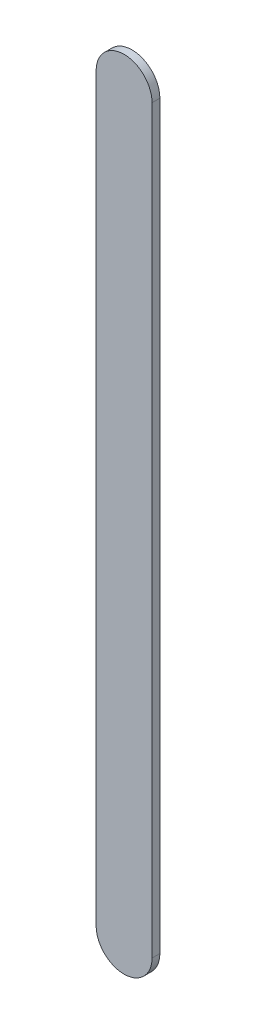
ISO-10303-21;
HEADER;
FILE_DESCRIPTION(('STEP AP214'),'2;1');
FILE_NAME('part.step','',(''),(''),'','','');
FILE_SCHEMA(('AUTOMOTIVE_DESIGN { 1 0 10303 214 1 1 1 1 }'));
ENDSEC;
DATA;
#1=APPLICATION_CONTEXT('core data for automotive mechanical design processes');
#2=APPLICATION_PROTOCOL_DEFINITION('international standard','automotive_design',2000,#1);
#3=PRODUCT_CONTEXT('',#1,'mechanical');
#4=PRODUCT('Part','Part','',(#3));
#5=PRODUCT_RELATED_PRODUCT_CATEGORY('part','',(#4));
#6=PRODUCT_DEFINITION_FORMATION('','',#4);
#7=PRODUCT_DEFINITION_CONTEXT('part definition',#1,'design');
#8=PRODUCT_DEFINITION('design','',#6,#7);
#9=PRODUCT_DEFINITION_SHAPE('','',#8);
#10=(LENGTH_UNIT() NAMED_UNIT(*) SI_UNIT(.MILLI.,.METRE.));
#11=(NAMED_UNIT(*) PLANE_ANGLE_UNIT() SI_UNIT($,.RADIAN.));
#12=(NAMED_UNIT(*) SI_UNIT($,.STERADIAN.) SOLID_ANGLE_UNIT());
#13=UNCERTAINTY_MEASURE_WITH_UNIT(LENGTH_MEASURE(1.E-05),#10,'distance_accuracy_value','');
#14=(GEOMETRIC_REPRESENTATION_CONTEXT(3) GLOBAL_UNCERTAINTY_ASSIGNED_CONTEXT((#13)) GLOBAL_UNIT_ASSIGNED_CONTEXT((#10,
#11,#12)) REPRESENTATION_CONTEXT('',''));
#15=CARTESIAN_POINT('',(0.,0.,0.));
#16=DIRECTION('',(0.,0.,1.));
#17=DIRECTION('',(1.,0.,0.));
#18=AXIS2_PLACEMENT_3D('',#15,#16,#17);
#19=CARTESIAN_POINT('',(97.64395,53.3212421,0.));
#20=DIRECTION('',(-1.,0.,0.));
#21=DIRECTION('',(0.,1.,0.));
#22=AXIS2_PLACEMENT_3D('',#19,#20,#21);
#23=PLANE('',#22);
#24=DIRECTION('',(0.,1.,0.));
#25=VECTOR('',#24,1.);
#26=CARTESIAN_POINT('',(97.64395,53.3212421,0.03556));
#27=LINE('',#26,#25);
#28=CARTESIAN_POINT('',(97.64395,53.3212421,0.03556));
#29=VERTEX_POINT('',#28);
#30=CARTESIAN_POINT('',(97.64395,56.6870088,0.03556));
#31=VERTEX_POINT('',#30);
#32=EDGE_CURVE('E11',#29,#31,#27,.T.);
#33=ORIENTED_EDGE('',*,*,#32,.F.);
#34=DIRECTION('',(0.,0.,1.));
#35=VECTOR('',#34,1.);
#36=CARTESIAN_POINT('',(97.64395,53.3212421,0.));
#37=LINE('',#36,#35);
#38=CARTESIAN_POINT('',(97.64395,53.3212421,0.));
#39=VERTEX_POINT('',#38);
#40=EDGE_CURVE('E24',#39,#29,#37,.T.);
#41=ORIENTED_EDGE('',*,*,#40,.F.);
#42=DIRECTION('',(0.,1.,0.));
#43=VECTOR('',#42,1.);
#44=CARTESIAN_POINT('',(97.64395,53.3212421,0.));
#45=LINE('',#44,#43);
#46=CARTESIAN_POINT('',(97.64395,56.6870088,0.));
#47=VERTEX_POINT('',#46);
#48=EDGE_CURVE('E75',#39,#47,#45,.T.);
#49=ORIENTED_EDGE('',*,*,#48,.T.);
#50=DIRECTION('',(0.,0.,1.));
#51=VECTOR('',#50,1.);
#52=CARTESIAN_POINT('',(97.64395,56.6870088,0.));
#53=LINE('',#52,#51);
#54=EDGE_CURVE('E37',#47,#31,#53,.T.);
#55=ORIENTED_EDGE('',*,*,#54,.T.);
#56=EDGE_LOOP('',(#33,#41,#49,#55));
#57=FACE_BOUND('',#56,.T.);
#58=ADVANCED_FACE('F17',(#57),#23,.F.);
#59=CARTESIAN_POINT('',(97.51695,56.6870088,0.));
#60=DIRECTION('',(0.,0.,-1.));
#61=DIRECTION('',(1.,0.,0.));
#62=AXIS2_PLACEMENT_3D('',#59,#60,#61);
#63=CYLINDRICAL_SURFACE('',#62,0.127);
#64=CARTESIAN_POINT('',(97.51695,56.6870088,0.03556));
#65=DIRECTION('',(0.,0.,1.));
#66=DIRECTION('',(1.,0.,0.));
#67=AXIS2_PLACEMENT_3D('',#64,#65,#66);
#68=CIRCLE('',#67,0.127);
#69=CARTESIAN_POINT('',(97.38995,56.6870088,0.03556));
#70=VERTEX_POINT('',#69);
#71=EDGE_CURVE('E83',#31,#70,#68,.T.);
#72=ORIENTED_EDGE('',*,*,#71,.F.);
#73=ORIENTED_EDGE('',*,*,#54,.F.);
#74=CARTESIAN_POINT('',(97.51695,56.6870088,0.));
#75=DIRECTION('',(0.,0.,1.));
#76=DIRECTION('',(1.,0.,0.));
#77=AXIS2_PLACEMENT_3D('',#74,#75,#76);
#78=CIRCLE('',#77,0.127);
#79=CARTESIAN_POINT('',(97.38995,56.6870088,0.));
#80=VERTEX_POINT('',#79);
#81=EDGE_CURVE('E81',#47,#80,#78,.T.);
#82=ORIENTED_EDGE('',*,*,#81,.T.);
#83=DIRECTION('',(0.,0.,1.));
#84=VECTOR('',#83,1.);
#85=CARTESIAN_POINT('',(97.38995,56.6870088,0.));
#86=LINE('',#85,#84);
#87=EDGE_CURVE('E67',#80,#70,#86,.T.);
#88=ORIENTED_EDGE('',*,*,#87,.T.);
#89=EDGE_LOOP('',(#72,#73,#82,#88));
#90=FACE_BOUND('',#89,.T.);
#91=ADVANCED_FACE('F89',(#90),#63,.T.);
#92=CARTESIAN_POINT('',(97.38995,56.6870088,0.));
#93=DIRECTION('',(1.,0.,0.));
#94=DIRECTION('',(0.,-1.,0.));
#95=AXIS2_PLACEMENT_3D('',#92,#93,#94);
#96=PLANE('',#95);
#97=DIRECTION('',(0.,-1.,0.));
#98=VECTOR('',#97,1.);
#99=CARTESIAN_POINT('',(97.38995,56.6870088,0.03556));
#100=LINE('',#99,#98);
#101=CARTESIAN_POINT('',(97.38995,53.3212421,0.03556));
#102=VERTEX_POINT('',#101);
#103=EDGE_CURVE('E71',#70,#102,#100,.T.);
#104=ORIENTED_EDGE('',*,*,#103,.F.);
#105=ORIENTED_EDGE('',*,*,#87,.F.);
#106=DIRECTION('',(0.,-1.,0.));
#107=VECTOR('',#106,1.);
#108=CARTESIAN_POINT('',(97.38995,56.6870088,0.));
#109=LINE('',#108,#107);
#110=CARTESIAN_POINT('',(97.38995,53.3212421,0.));
#111=VERTEX_POINT('',#110);
#112=EDGE_CURVE('E63',#80,#111,#109,.T.);
#113=ORIENTED_EDGE('',*,*,#112,.T.);
#114=DIRECTION('',(0.,0.,1.));
#115=VECTOR('',#114,1.);
#116=CARTESIAN_POINT('',(97.38995,53.3212421,0.));
#117=LINE('',#116,#115);
#118=EDGE_CURVE('E53',#111,#102,#117,.T.);
#119=ORIENTED_EDGE('',*,*,#118,.T.);
#120=EDGE_LOOP('',(#104,#105,#113,#119));
#121=FACE_BOUND('',#120,.T.);
#122=ADVANCED_FACE('F66',(#121),#96,.F.);
#123=CARTESIAN_POINT('',(97.51695,53.3212421,0.));
#124=DIRECTION('',(0.,0.,-1.));
#125=DIRECTION('',(-1.,0.,0.));
#126=AXIS2_PLACEMENT_3D('',#123,#124,#125);
#127=CYLINDRICAL_SURFACE('',#126,0.127000000000002);
#128=CARTESIAN_POINT('',(97.51695,53.3212421,0.03556));
#129=DIRECTION('',(0.,0.,1.));
#130=DIRECTION('',(-1.,0.,0.));
#131=AXIS2_PLACEMENT_3D('',#128,#129,#130);
#132=CIRCLE('',#131,0.127000000000002);
#133=EDGE_CURVE('E59',#102,#29,#132,.T.);
#134=ORIENTED_EDGE('',*,*,#133,.F.);
#135=ORIENTED_EDGE('',*,*,#118,.F.);
#136=CARTESIAN_POINT('',(97.51695,53.3212421,0.));
#137=DIRECTION('',(0.,0.,1.));
#138=DIRECTION('',(-1.,0.,0.));
#139=AXIS2_PLACEMENT_3D('',#136,#137,#138);
#140=CIRCLE('',#139,0.127000000000002);
#141=EDGE_CURVE('E57',#111,#39,#140,.T.);
#142=ORIENTED_EDGE('',*,*,#141,.T.);
#143=ORIENTED_EDGE('',*,*,#40,.T.);
#144=EDGE_LOOP('',(#134,#135,#142,#143));
#145=FACE_BOUND('',#144,.T.);
#146=ADVANCED_FACE('F55',(#145),#127,.T.);
#147=CARTESIAN_POINT('',(97.64395,53.3212421,0.));
#148=DIRECTION('',(0.,0.,-1.));
#149=DIRECTION('',(-1.,0.,0.));
#150=AXIS2_PLACEMENT_3D('',#147,#148,#149);
#151=PLANE('',#150);
#152=ORIENTED_EDGE('',*,*,#141,.F.);
#153=ORIENTED_EDGE('',*,*,#112,.F.);
#154=ORIENTED_EDGE('',*,*,#81,.F.);
#155=ORIENTED_EDGE('',*,*,#48,.F.);
#156=EDGE_LOOP('',(#152,#153,#154,#155));
#157=FACE_BOUND('',#156,.T.);
#158=ADVANCED_FACE('F74',(#157),#151,.T.);
#159=CARTESIAN_POINT('',(97.64395,53.3212421,0.03556));
#160=DIRECTION('',(0.,0.,-1.));
#161=DIRECTION('',(-1.,0.,0.));
#162=AXIS2_PLACEMENT_3D('',#159,#160,#161);
#163=PLANE('',#162);
#164=ORIENTED_EDGE('',*,*,#32,.T.);
#165=ORIENTED_EDGE('',*,*,#71,.T.);
#166=ORIENTED_EDGE('',*,*,#103,.T.);
#167=ORIENTED_EDGE('',*,*,#133,.T.);
#168=EDGE_LOOP('',(#164,#165,#166,#167));
#169=FACE_BOUND('',#168,.T.);
#170=ADVANCED_FACE('F91',(#169),#163,.F.);
#171=CLOSED_SHELL('',(#58,#91,#122,#146,#158,#170));
#172=MANIFOLD_SOLID_BREP('B1',#171);
#173=ADVANCED_BREP_SHAPE_REPRESENTATION('',(#18,#172),#14);
#174=SHAPE_DEFINITION_REPRESENTATION(#9,#173);
ENDSEC;
END-ISO-10303-21;
